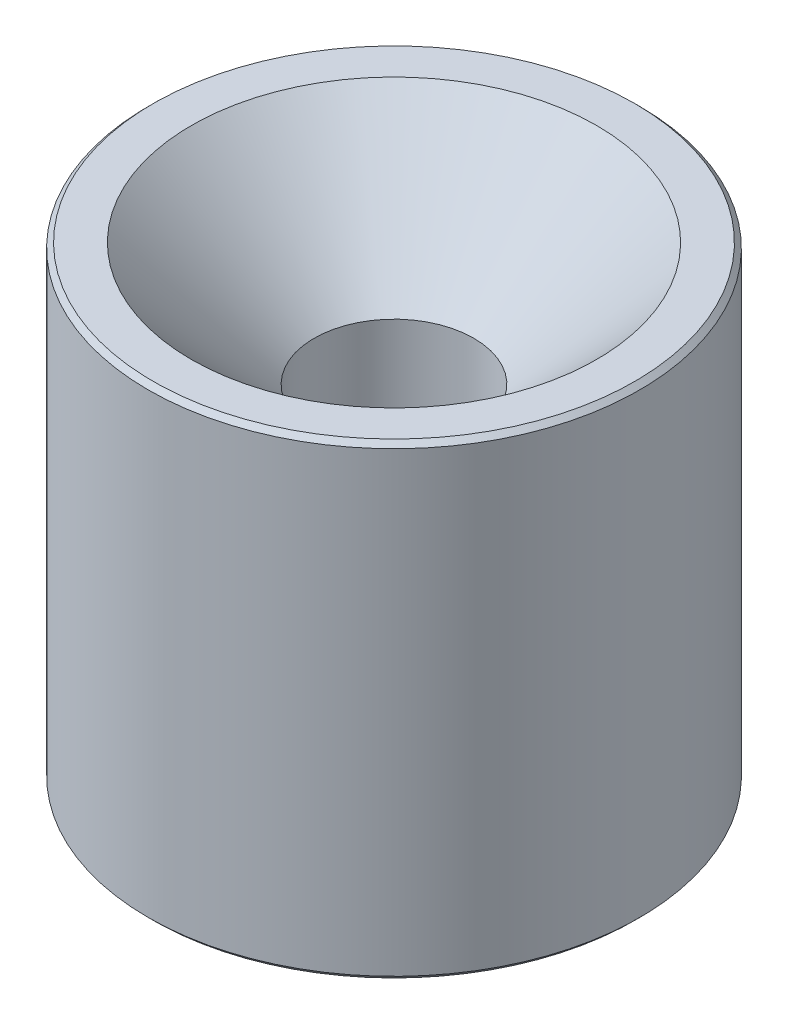
ISO-10303-21;
HEADER;
FILE_DESCRIPTION(('STEP AP214'),'2;1');
FILE_NAME('part.step','',(''),(''),'','','');
FILE_SCHEMA(('AUTOMOTIVE_DESIGN { 1 0 10303 214 1 1 1 1 }'));
ENDSEC;
DATA;
#1=APPLICATION_CONTEXT('core data for automotive mechanical design processes');
#2=APPLICATION_PROTOCOL_DEFINITION('international standard','automotive_design',2000,#1);
#3=PRODUCT_CONTEXT('',#1,'mechanical');
#4=PRODUCT('Part','Part','',(#3));
#5=PRODUCT_RELATED_PRODUCT_CATEGORY('part','',(#4));
#6=PRODUCT_DEFINITION_FORMATION('','',#4);
#7=PRODUCT_DEFINITION_CONTEXT('part definition',#1,'design');
#8=PRODUCT_DEFINITION('design','',#6,#7);
#9=PRODUCT_DEFINITION_SHAPE('','',#8);
#10=(LENGTH_UNIT() NAMED_UNIT(*) SI_UNIT(.MILLI.,.METRE.));
#11=(NAMED_UNIT(*) PLANE_ANGLE_UNIT() SI_UNIT($,.RADIAN.));
#12=(NAMED_UNIT(*) SI_UNIT($,.STERADIAN.) SOLID_ANGLE_UNIT());
#13=UNCERTAINTY_MEASURE_WITH_UNIT(LENGTH_MEASURE(1.E-05),#10,'distance_accuracy_value','');
#14=(GEOMETRIC_REPRESENTATION_CONTEXT(3) GLOBAL_UNCERTAINTY_ASSIGNED_CONTEXT((#13)) GLOBAL_UNIT_ASSIGNED_CONTEXT((#10,
#11,#12)) REPRESENTATION_CONTEXT('',''));
#15=CARTESIAN_POINT('',(0.,0.,0.));
#16=DIRECTION('',(0.,0.,1.));
#17=DIRECTION('',(1.,0.,0.));
#18=AXIS2_PLACEMENT_3D('',#15,#16,#17);
#19=CARTESIAN_POINT('',(0.,-9.3,0.));
#20=DIRECTION('',(0.,-1.,0.));
#21=DIRECTION('',(0.,0.,-1.));
#22=AXIS2_PLACEMENT_3D('',#19,#20,#21);
#23=CONICAL_SURFACE('',#22,3.25,0.78539816339744);
#24=CARTESIAN_POINT('',(0.,-9.5,0.));
#25=DIRECTION('',(0.,-1.,0.));
#26=DIRECTION('',(0.,0.,-1.));
#27=AXIS2_PLACEMENT_3D('',#24,#25,#26);
#28=CIRCLE('',#27,3.45);
#29=CARTESIAN_POINT('',(0.,-9.5,-3.45));
#30=VERTEX_POINT('',#29);
#31=EDGE_CURVE('E10',#30,#30,#28,.T.);
#32=ORIENTED_EDGE('',*,*,#31,.T.);
#33=EDGE_LOOP('',(#32));
#34=FACE_BOUND('',#33,.T.);
#35=CARTESIAN_POINT('',(0.,-9.3,0.));
#36=DIRECTION('',(0.,-1.,0.));
#37=DIRECTION('',(0.,0.,-1.));
#38=AXIS2_PLACEMENT_3D('',#35,#36,#37);
#39=CIRCLE('',#38,3.25);
#40=CARTESIAN_POINT('',(0.,-9.3,-3.25));
#41=VERTEX_POINT('',#40);
#42=EDGE_CURVE('E59',#41,#41,#39,.T.);
#43=ORIENTED_EDGE('',*,*,#42,.F.);
#44=EDGE_LOOP('',(#43));
#45=FACE_BOUND('',#44,.T.);
#46=ADVANCED_FACE('F31',(#34,#45),#23,.F.);
#47=CARTESIAN_POINT('',(3.45,-9.5,0.));
#48=DIRECTION('',(0.,-1.,0.));
#49=DIRECTION('',(0.,0.,-1.));
#50=AXIS2_PLACEMENT_3D('',#47,#48,#49);
#51=PLANE('',#50);
#52=CARTESIAN_POINT('',(0.,-9.5,0.));
#53=DIRECTION('',(0.,-1.,0.));
#54=DIRECTION('',(0.,0.,-1.));
#55=AXIS2_PLACEMENT_3D('',#52,#53,#54);
#56=CIRCLE('',#55,9.8);
#57=CARTESIAN_POINT('',(0.,-9.5,-9.8));
#58=VERTEX_POINT('',#57);
#59=EDGE_CURVE('E37',#58,#58,#56,.T.);
#60=ORIENTED_EDGE('',*,*,#59,.T.);
#61=EDGE_LOOP('',(#60));
#62=FACE_BOUND('',#61,.T.);
#63=ORIENTED_EDGE('',*,*,#31,.F.);
#64=EDGE_LOOP('',(#63));
#65=FACE_BOUND('',#64,.T.);
#66=ADVANCED_FACE('F67',(#62,#65),#51,.T.);
#67=CARTESIAN_POINT('',(0.,-9.5,0.));
#68=DIRECTION('',(0.,1.,0.));
#69=DIRECTION('',(0.,0.,1.));
#70=AXIS2_PLACEMENT_3D('',#67,#68,#69);
#71=CONICAL_SURFACE('',#70,9.8,0.785398163397444);
#72=CARTESIAN_POINT('',(0.,-9.3,0.));
#73=DIRECTION('',(0.,-1.,0.));
#74=DIRECTION('',(0.,0.,-1.));
#75=AXIS2_PLACEMENT_3D('',#72,#73,#74);
#76=CIRCLE('',#75,10.);
#77=CARTESIAN_POINT('',(0.,-9.3,-10.));
#78=VERTEX_POINT('',#77);
#79=EDGE_CURVE('E41',#78,#78,#76,.T.);
#80=ORIENTED_EDGE('',*,*,#79,.T.);
#81=EDGE_LOOP('',(#80));
#82=FACE_BOUND('',#81,.T.);
#83=ORIENTED_EDGE('',*,*,#59,.F.);
#84=EDGE_LOOP('',(#83));
#85=FACE_BOUND('',#84,.T.);
#86=ADVANCED_FACE('F71',(#82,#85),#71,.T.);
#87=CARTESIAN_POINT('',(0.,9.5,0.));
#88=DIRECTION('',(0.,-1.,0.));
#89=DIRECTION('',(0.,0.,-1.));
#90=AXIS2_PLACEMENT_3D('',#87,#88,#89);
#91=CYLINDRICAL_SURFACE('',#90,10.);
#92=CARTESIAN_POINT('',(0.,9.3,0.));
#93=DIRECTION('',(0.,-1.,0.));
#94=DIRECTION('',(0.,0.,-1.));
#95=AXIS2_PLACEMENT_3D('',#92,#93,#94);
#96=CIRCLE('',#95,10.);
#97=CARTESIAN_POINT('',(0.,9.3,-10.));
#98=VERTEX_POINT('',#97);
#99=EDGE_CURVE('E45',#98,#98,#96,.T.);
#100=ORIENTED_EDGE('',*,*,#99,.T.);
#101=EDGE_LOOP('',(#100));
#102=FACE_BOUND('',#101,.T.);
#103=ORIENTED_EDGE('',*,*,#79,.F.);
#104=EDGE_LOOP('',(#103));
#105=FACE_BOUND('',#104,.T.);
#106=ADVANCED_FACE('F75',(#102,#105),#91,.T.);
#107=CARTESIAN_POINT('',(0.,9.3,0.));
#108=DIRECTION('',(0.,-1.,0.));
#109=DIRECTION('',(0.,0.,-1.));
#110=AXIS2_PLACEMENT_3D('',#107,#108,#109);
#111=CONICAL_SURFACE('',#110,10.,0.785398163397453);
#112=CARTESIAN_POINT('',(0.,9.5,0.));
#113=DIRECTION('',(0.,-1.,0.));
#114=DIRECTION('',(0.,0.,-1.));
#115=AXIS2_PLACEMENT_3D('',#112,#113,#114);
#116=CIRCLE('',#115,9.8);
#117=CARTESIAN_POINT('',(0.,9.5,-9.8));
#118=VERTEX_POINT('',#117);
#119=EDGE_CURVE('E50',#118,#118,#116,.T.);
#120=ORIENTED_EDGE('',*,*,#119,.T.);
#121=EDGE_LOOP('',(#120));
#122=FACE_BOUND('',#121,.T.);
#123=ORIENTED_EDGE('',*,*,#99,.F.);
#124=EDGE_LOOP('',(#123));
#125=FACE_BOUND('',#124,.T.);
#126=ADVANCED_FACE('F82',(#122,#125),#111,.T.);
#127=CARTESIAN_POINT('',(9.8,9.5,0.));
#128=DIRECTION('',(0.,1.,0.));
#129=DIRECTION('',(0.,0.,1.));
#130=AXIS2_PLACEMENT_3D('',#127,#128,#129);
#131=PLANE('',#130);
#132=CARTESIAN_POINT('',(0.,9.5,0.));
#133=DIRECTION('',(0.,-1.,0.));
#134=DIRECTION('',(0.,0.,-1.));
#135=AXIS2_PLACEMENT_3D('',#132,#133,#134);
#136=CIRCLE('',#135,8.25);
#137=CARTESIAN_POINT('',(0.,9.5,-8.25));
#138=VERTEX_POINT('',#137);
#139=EDGE_CURVE('E53',#138,#138,#136,.T.);
#140=ORIENTED_EDGE('',*,*,#139,.T.);
#141=EDGE_LOOP('',(#140));
#142=FACE_BOUND('',#141,.T.);
#143=ORIENTED_EDGE('',*,*,#119,.F.);
#144=EDGE_LOOP('',(#143));
#145=FACE_BOUND('',#144,.T.);
#146=ADVANCED_FACE('F86',(#142,#145),#131,.T.);
#147=CARTESIAN_POINT('',(0.,9.5,0.));
#148=DIRECTION('',(0.,1.,0.));
#149=DIRECTION('',(0.,0.,1.));
#150=AXIS2_PLACEMENT_3D('',#147,#148,#149);
#151=CONICAL_SURFACE('',#150,8.25,0.785398163397448);
#152=CARTESIAN_POINT('',(0.,4.5,0.));
#153=DIRECTION('',(0.,-1.,0.));
#154=DIRECTION('',(0.,0.,-1.));
#155=AXIS2_PLACEMENT_3D('',#152,#153,#154);
#156=CIRCLE('',#155,3.25);
#157=CARTESIAN_POINT('',(0.,4.5,-3.25));
#158=VERTEX_POINT('',#157);
#159=EDGE_CURVE('E56',#158,#158,#156,.T.);
#160=ORIENTED_EDGE('',*,*,#159,.T.);
#161=EDGE_LOOP('',(#160));
#162=FACE_BOUND('',#161,.T.);
#163=ORIENTED_EDGE('',*,*,#139,.F.);
#164=EDGE_LOOP('',(#163));
#165=FACE_BOUND('',#164,.T.);
#166=ADVANCED_FACE('F90',(#162,#165),#151,.F.);
#167=CARTESIAN_POINT('',(0.,9.5,0.));
#168=DIRECTION('',(0.,-1.,0.));
#169=DIRECTION('',(0.,0.,-1.));
#170=AXIS2_PLACEMENT_3D('',#167,#168,#169);
#171=CYLINDRICAL_SURFACE('',#170,3.25);
#172=ORIENTED_EDGE('',*,*,#42,.T.);
#173=EDGE_LOOP('',(#172));
#174=FACE_BOUND('',#173,.T.);
#175=ORIENTED_EDGE('',*,*,#159,.F.);
#176=EDGE_LOOP('',(#175));
#177=FACE_BOUND('',#176,.T.);
#178=ADVANCED_FACE('F63',(#174,#177),#171,.F.);
#179=CLOSED_SHELL('',(#46,#66,#86,#106,#126,#146,#166,#178));
#180=MANIFOLD_SOLID_BREP('B2',#179);
#181=ADVANCED_BREP_SHAPE_REPRESENTATION('',(#18,#180),#14);
#182=SHAPE_DEFINITION_REPRESENTATION(#9,#181);
ENDSEC;
END-ISO-10303-21;
